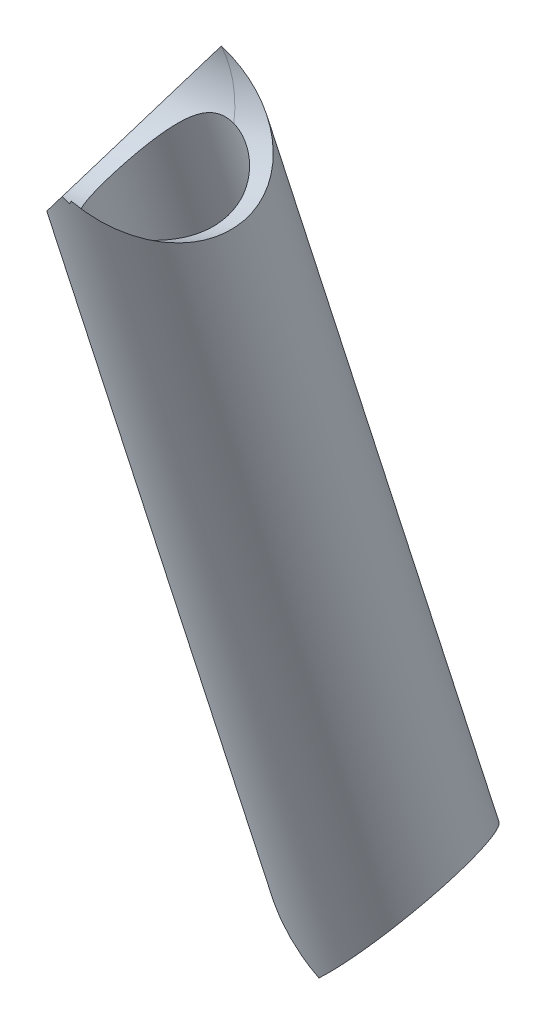
ISO-10303-21;
HEADER;
FILE_DESCRIPTION(('STEP AP214'),'2;1');
FILE_NAME('part.step','',(''),(''),'','','');
FILE_SCHEMA(('AUTOMOTIVE_DESIGN { 1 0 10303 214 1 1 1 1 }'));
ENDSEC;
DATA;
#1=APPLICATION_CONTEXT('core data for automotive mechanical design processes');
#2=APPLICATION_PROTOCOL_DEFINITION('international standard','automotive_design',2000,#1);
#3=PRODUCT_CONTEXT('',#1,'mechanical');
#4=PRODUCT('Part','Part','',(#3));
#5=PRODUCT_RELATED_PRODUCT_CATEGORY('part','',(#4));
#6=PRODUCT_DEFINITION_FORMATION('','',#4);
#7=PRODUCT_DEFINITION_CONTEXT('part definition',#1,'design');
#8=PRODUCT_DEFINITION('design','',#6,#7);
#9=PRODUCT_DEFINITION_SHAPE('','',#8);
#10=(LENGTH_UNIT() NAMED_UNIT(*) SI_UNIT(.MILLI.,.METRE.));
#11=(NAMED_UNIT(*) PLANE_ANGLE_UNIT() SI_UNIT($,.RADIAN.));
#12=(NAMED_UNIT(*) SI_UNIT($,.STERADIAN.) SOLID_ANGLE_UNIT());
#13=UNCERTAINTY_MEASURE_WITH_UNIT(LENGTH_MEASURE(1.E-05),#10,'distance_accuracy_value','');
#14=(GEOMETRIC_REPRESENTATION_CONTEXT(3) GLOBAL_UNCERTAINTY_ASSIGNED_CONTEXT((#13)) GLOBAL_UNIT_ASSIGNED_CONTEXT((#10,
#11,#12)) REPRESENTATION_CONTEXT('',''));
#15=CARTESIAN_POINT('',(0.,0.,0.));
#16=DIRECTION('',(0.,0.,1.));
#17=DIRECTION('',(1.,0.,0.));
#18=AXIS2_PLACEMENT_3D('',#15,#16,#17);
#19=CARTESIAN_POINT('',(549.76326332179,1.17961196366423E-13,200.));
#20=DIRECTION('',(0.,0.95272535252887,0.303832853142546));
#21=DIRECTION('',(0.,-0.303832853142546,0.952725352528871));
#22=AXIS2_PLACEMENT_3D('',#19,#20,#21);
#23=CYLINDRICAL_SURFACE('',#22,9.65000000000003);
#24=CARTESIAN_POINT('',(550.698039428662,109.484435551692,244.996794368476));
#25=CARTESIAN_POINT('',(550.881581643102,109.566394338462,245.004213785763));
#26=CARTESIAN_POINT('',(551.067205147599,109.644542456331,245.004567755101));
#27=CARTESIAN_POINT('',(551.441272790003,109.792442626243,244.990319027908));
#28=CARTESIAN_POINT('',(551.629717996396,109.862191402456,244.97571051683));
#29=CARTESIAN_POINT('',(552.006309312038,109.991890817097,244.930898310792));
#30=CARTESIAN_POINT('',(552.194443954556,110.051920856962,244.900830360672));
#31=CARTESIAN_POINT('',(552.570217718864,110.162658830874,244.824920725487));
#32=CARTESIAN_POINT('',(552.757856955263,110.213369149442,244.77908308386));
#33=CARTESIAN_POINT('',(553.131337378484,110.305875102178,244.671707070123));
#34=CARTESIAN_POINT('',(553.317173070384,110.347648714515,244.610130715032));
#35=CARTESIAN_POINT('',(553.684904472099,110.422906426049,244.471971576444));
#36=CARTESIAN_POINT('',(553.866799660256,110.456389433752,244.395386819401));
#37=CARTESIAN_POINT('',(554.225484036437,110.516245356894,244.228022283843));
#38=CARTESIAN_POINT('',(554.402264543243,110.54260675216,244.137219876654));
#39=CARTESIAN_POINT('',(554.749321723969,110.589495836218,243.942584303863));
#40=CARTESIAN_POINT('',(554.919596748016,110.610022053525,243.838747860903));
#41=CARTESIAN_POINT('',(555.299177028189,110.651736875844,243.588575847054));
#42=CARTESIAN_POINT('',(555.506148369993,110.671518490651,243.438457210947));
#43=CARTESIAN_POINT('',(555.906788012326,110.706638809108,243.120934223244));
#44=CARTESIAN_POINT('',(556.100452562977,110.721976264272,242.953525032138));
#45=CARTESIAN_POINT('',(556.473769897959,110.750737217947,242.603205122193));
#46=CARTESIAN_POINT('',(556.653405791074,110.764158424818,242.420276253129));
#47=CARTESIAN_POINT('',(556.997666401102,110.791242420639,242.040864301523));
#48=CARTESIAN_POINT('',(557.162292190321,110.804905192248,241.844382188974));
#49=CARTESIAN_POINT('',(557.478348379293,110.834550919873,241.436261312558));
#50=CARTESIAN_POINT('',(557.629530642542,110.850566975223,241.224432829273));
#51=CARTESIAN_POINT('',(557.915033371628,110.886373108481,240.790003674337));
#52=CARTESIAN_POINT('',(558.049353720248,110.906163212622,240.567402927815));
#53=CARTESIAN_POINT('',(558.300343888742,110.950843614606,240.1130933081));
#54=CARTESIAN_POINT('',(558.417022553328,110.975731341903,239.881389072871));
#55=CARTESIAN_POINT('',(558.632072138232,111.031693868641,239.41034225666));
#56=CARTESIAN_POINT('',(558.73044238973,111.062768894023,239.170999397007));
#57=CARTESIAN_POINT('',(558.914537580053,111.134441459816,238.66887530459));
#58=CARTESIAN_POINT('',(558.998844049748,111.175563161971,238.405646463527));
#59=CARTESIAN_POINT('',(559.14474216268,111.26663147728,237.874436356593));
#60=CARTESIAN_POINT('',(559.206332567954,111.316578571175,237.606454832547));
#61=CARTESIAN_POINT('',(559.306082308514,111.42572068666,237.068043330455));
#62=CARTESIAN_POINT('',(559.34424420614,111.484914696041,236.797613623447));
#63=CARTESIAN_POINT('',(559.396629612229,111.612668506386,236.2566534733));
#64=CARTESIAN_POINT('',(559.410854975487,111.681227581225,235.986123039592));
#65=CARTESIAN_POINT('',(559.41497267861,111.822775813274,235.464792583113));
#66=CARTESIAN_POINT('',(559.406378912521,111.895191884138,235.213847854031));
#67=CARTESIAN_POINT('',(559.368035815093,112.047628921864,234.715920544952));
#68=CARTESIAN_POINT('',(559.338287390049,112.127649562809,234.468937795682));
#69=CARTESIAN_POINT('',(559.257879022078,112.294648434509,233.980850403866));
#70=CARTESIAN_POINT('',(559.207222671558,112.381625467945,233.739744759047));
#71=CARTESIAN_POINT('',(559.08545419463,112.561710102316,233.265112507336));
#72=CARTESIAN_POINT('',(559.014342171348,112.654817672343,233.031585862242));
#73=CARTESIAN_POINT('',(558.854852446097,112.843140803751,232.58085840355));
#74=CARTESIAN_POINT('',(558.767084963752,112.938199118691,232.363375364454));
#75=CARTESIAN_POINT('',(558.573698403751,113.132029938323,231.938240267824));
#76=CARTESIAN_POINT('',(558.468079840252,113.230802335974,231.730587927359));
#77=CARTESIAN_POINT('',(558.239827336573,113.43085231516,231.326173037617));
#78=CARTESIAN_POINT('',(558.117195261543,113.532129621088,231.12940929795));
#79=CARTESIAN_POINT('',(557.855783983508,113.73588508475,230.747580192732));
#80=CARTESIAN_POINT('',(557.717004132927,113.838363290496,230.562515296802));
#81=CARTESIAN_POINT('',(557.417454025893,114.04779533895,230.196500000782));
#82=CARTESIAN_POINT('',(557.255965694797,114.154738123503,230.016130864163));
#83=CARTESIAN_POINT('',(556.917315168159,114.36656108676,229.669445096046));
#84=CARTESIAN_POINT('',(556.740152440746,114.471441195325,229.503128941775));
#85=CARTESIAN_POINT('',(556.370804864086,114.67731490012,229.184630482026));
#86=CARTESIAN_POINT('',(556.17859413249,114.778301333519,229.032473559324));
#87=CARTESIAN_POINT('',(555.780365612246,114.973919860812,228.742837046828));
#88=CARTESIAN_POINT('',(555.574347472067,115.068551792801,228.605357830953));
#89=CARTESIAN_POINT('',(555.136205118418,115.254475255379,228.337075078194));
#90=CARTESIAN_POINT('',(554.903254144052,115.345192436493,228.20721937849));
#91=CARTESIAN_POINT('',(554.423984993501,115.512913232271,227.964174746746));
#92=CARTESIAN_POINT('',(554.177664101202,115.589914046731,227.850989218744));
#93=CARTESIAN_POINT('',(553.674012405421,115.725757345622,227.641584260961));
#94=CARTESIAN_POINT('',(553.416719274576,115.78465703395,227.545311803749));
#95=CARTESIAN_POINT('',(552.892562630669,115.879942104992,227.369193553604));
#96=CARTESIAN_POINT('',(552.625705560243,115.916342353425,227.28933693781));
#97=CARTESIAN_POINT('',(552.172695592737,115.954626211558,227.168930621738));
#98=CARTESIAN_POINT('',(551.98830034342,115.963859191771,227.124014028903));
#99=CARTESIAN_POINT('',(551.617736437598,115.968626230974,227.041423558787));
#100=CARTESIAN_POINT('',(551.431568284748,115.96416407124,227.00374768537));
#101=CARTESIAN_POINT('',(551.058960029859,115.940610303518,226.935455022241));
#102=CARTESIAN_POINT('',(550.872520152049,115.921527297861,226.90483409545));
#103=CARTESIAN_POINT('',(550.500862439488,115.868320136744,226.850362452704));
#104=CARTESIAN_POINT('',(550.315644350711,115.834199214752,226.826510283135));
#105=CARTESIAN_POINT('',(549.890174376933,115.737950368295,226.778759760704));
#106=CARTESIAN_POINT('',(549.650857480254,115.670397418027,226.757187374206));
#107=CARTESIAN_POINT('',(549.297590076094,115.551063811716,226.732497674503));
#108=CARTESIAN_POINT('',(549.180755973486,115.508271781476,226.725545111857));
#109=CARTESIAN_POINT('',(548.94919801947,115.417028447761,226.71408248341));
#110=CARTESIAN_POINT('',(548.834474108189,115.368577305141,226.709572348204));
#111=CARTESIAN_POINT('',(548.720894557649,115.317466106978,226.706224291481));
#112=B_SPLINE_CURVE_WITH_KNOTS('',3,(#24,#25,#26,#27,#28,#29,#30,#31,#32,#33,#34,#35,#36,#37,
#38,#39,#40,#41,#42,#43,#44,#45,#46,#47,#48,#49,#50,#51,#52,#53,#54,#55,#56,#57,#58,#59,#60,#61,
#62,#63,#64,#65,#66,#67,#68,#69,#70,#71,#72,#73,#74,#75,#76,#77,#78,#79,#80,#81,#82,#83,#84,#85,
#86,#87,#88,#89,#90,#91,#92,#93,#94,#95,#96,#97,#98,#99,#100,#101,#102,#103,#104,#105,#106,#107,
#108,#109,#110,#111),.UNSPECIFIED.,.F.,.F.,(4,2,2,2,2,2,2,2,2,2,2,2,2,2,2,2,2,2,2,2,2,2,2,2,2,2,
2,2,2,2,2,2,2,2,2,2,2,2,2,2,2,2,2,4),(0.,0.603401911009914,1.20703839807765,1.80546282042542,
2.40373391754958,3.0034627125777,3.6032704225785,4.20404267070255,4.80496628437935,
5.57321395701299,6.34167724277525,7.11105197133311,7.88037169345746,8.66178608143956,
9.44320590124379,10.2242326454021,11.0052879154709,11.8425224944068,12.6798026935898,
13.5169913043671,14.3541150400877,15.1371105115038,15.9200724402833,16.7028998962525,
17.4857234057292,18.2440396320003,19.0023340204592,19.7605453445096,20.518787085754,
21.3119222678827,22.1050843734451,22.8996420142938,23.6942198918678,24.538244731251,
25.3824416816996,26.2239426625353,27.064887055007,27.6343517263137,28.2036591805505,
28.7726319335976,29.3414824051636,30.0885224507664,30.462236794177,30.8359405176508),.UNSPECIFIED.);
#113=CARTESIAN_POINT('',(552.9506630298,110.261122917512,244.723648048167));
#114=VERTEX_POINT('',#113);
#115=CARTESIAN_POINT('',(552.000788998511,115.961111324283,227.128263209496));
#116=VERTEX_POINT('',#115);
#117=EDGE_CURVE('E123',#114,#116,#112,.T.);
#118=ORIENTED_EDGE('',*,*,#117,.T.);
#119=CARTESIAN_POINT('',(549.76326332179,109.975863240767,245.201148674115));
#120=CARTESIAN_POINT('',(549.9634546001,110.019916320632,245.215196869599));
#121=CARTESIAN_POINT('',(550.165307901028,110.059083582522,245.221137583805));
#122=CARTESIAN_POINT('',(550.570552825056,110.127049074594,245.216106583122));
#123=CARTESIAN_POINT('',(550.773944438698,110.155847368475,245.205134972132));
#124=CARTESIAN_POINT('',(551.180423033904,110.203144725606,245.16612172139));
#125=CARTESIAN_POINT('',(551.383509708,110.221636660967,245.138068295826));
#126=CARTESIAN_POINT('',(551.787316770269,110.248998695428,245.065298121469));
#127=CARTESIAN_POINT('',(551.98803699928,110.257868150948,245.020580258379));
#128=CARTESIAN_POINT('',(552.383703703847,110.267166591259,244.915794468131));
#129=CARTESIAN_POINT('',(552.578685512266,110.267669415926,244.855865572658));
#130=CARTESIAN_POINT('',(552.963528778638,110.261908055358,244.721530033714));
#131=CARTESIAN_POINT('',(553.15338755417,110.255640392959,244.647115967093));
#132=CARTESIAN_POINT('',(553.714229729974,110.229072097724,244.403684156985));
#133=CARTESIAN_POINT('',(554.07628523899,110.201004703115,244.214529724227));
#134=CARTESIAN_POINT('',(554.666278688278,110.146113621938,243.855499316274));
#135=CARTESIAN_POINT('',(554.90165491087,110.12148241524,243.697102594484));
#136=CARTESIAN_POINT('',(555.358004067127,110.071501830009,243.360642036257));
#137=CARTESIAN_POINT('',(555.578972330568,110.046152222395,243.182571872731));
#138=CARTESIAN_POINT('',(556.005820845144,109.997716098286,242.808634613583));
#139=CARTESIAN_POINT('',(556.211689075402,109.97463138,242.612753611002));
#140=CARTESIAN_POINT('',(556.607410978175,109.933294290981,242.204993684445));
#141=CARTESIAN_POINT('',(556.797266232797,109.91504144247,241.993116344861));
#142=CARTESIAN_POINT('',(557.16199318824,109.885404324874,241.552591687812));
#143=CARTESIAN_POINT('',(557.336686679089,109.874094169562,241.323791676807));
#144=CARTESIAN_POINT('',(557.667738161875,109.860603739476,240.853003599556));
#145=CARTESIAN_POINT('',(557.82409565684,109.858423712105,240.611015176116));
#146=CARTESIAN_POINT('',(558.117116334747,109.864874764263,240.115731230429));
#147=CARTESIAN_POINT('',(558.253793105132,109.873498344766,239.862443668809));
#148=CARTESIAN_POINT('',(558.506224741361,109.902947677151,239.34631550793));
#149=CARTESIAN_POINT('',(558.621980840241,109.923772709591,239.083475472778));
#150=CARTESIAN_POINT('',(558.828082916247,109.977900091243,238.558362449391));
#151=CARTESIAN_POINT('',(558.919084636021,110.01081114634,238.296307051674));
#152=CARTESIAN_POINT('',(559.078946387722,110.089836451659,237.76744963628));
#153=CARTESIAN_POINT('',(559.147806588626,110.135950601113,237.500647654845));
#154=CARTESIAN_POINT('',(559.262355117916,110.241678135343,236.964920118654));
#155=CARTESIAN_POINT('',(559.308057990581,110.301283012962,236.695996004802));
#156=CARTESIAN_POINT('',(559.375637075682,110.433943460572,236.158480587196));
#157=CARTESIAN_POINT('',(559.397516112611,110.506997434873,235.889889247762));
#158=CARTESIAN_POINT('',(559.415953366756,110.656731163836,235.387073849114));
#159=CARTESIAN_POINT('',(559.415182232547,110.731978842211,235.152516344233));
#160=CARTESIAN_POINT('',(559.394828533204,110.891991545254,234.687516635222));
#161=CARTESIAN_POINT('',(559.375247702842,110.976755691605,234.457074053578));
#162=CARTESIAN_POINT('',(559.317527538014,111.155000094427,234.001988694555));
#163=CARTESIAN_POINT('',(559.279389686438,111.248479653968,233.777345455261));
#164=CARTESIAN_POINT('',(559.185022271188,111.44318287009,233.335337647127));
#165=CARTESIAN_POINT('',(559.12879236789,111.544406672018,233.117973215008));
#166=CARTESIAN_POINT('',(559.000371600791,111.751078284084,232.696698650233));
#167=CARTESIAN_POINT('',(558.928574897405,111.85637667972,232.492594559923));
#168=CARTESIAN_POINT('',(558.769042116872,112.072137351278,232.09357475383));
#169=CARTESIAN_POINT('',(558.681306482387,112.182599483728,231.89865878306));
#170=CARTESIAN_POINT('',(558.490685437882,112.407459048784,231.518806508098));
#171=CARTESIAN_POINT('',(558.387801531828,112.521856089858,231.33386921568));
#172=CARTESIAN_POINT('',(558.16766851358,112.753333443992,230.974509955233));
#173=CARTESIAN_POINT('',(558.050417781106,112.87041405849,230.800089176564));
#174=CARTESIAN_POINT('',(557.79135055153,113.11635895838,230.447211623137));
#175=CARTESIAN_POINT('',(557.648278285843,113.245349010812,230.269764019591));
#176=CARTESIAN_POINT('',(557.346974508563,113.503158797502,229.928116467741));
#177=CARTESIAN_POINT('',(557.188742149096,113.631978521825,229.763917261338));
#178=CARTESIAN_POINT('',(556.857648324522,113.887788248378,229.448615885941));
#179=CARTESIAN_POINT('',(556.684760892019,114.014774515625,229.297537967432));
#180=CARTESIAN_POINT('',(556.325318993714,114.264610029118,229.008821105734));
#181=CARTESIAN_POINT('',(556.138764223729,114.387459183199,228.871182461812));
#182=CARTESIAN_POINT('',(555.730287647052,114.640530891462,228.594147632414));
#183=CARTESIAN_POINT('',(555.506768715832,114.769968738686,228.456381003873));
#184=CARTESIAN_POINT('',(555.044138173575,115.017160632341,228.197282697493));
#185=CARTESIAN_POINT('',(554.805022261513,115.134911433186,228.07595558164));
#186=CARTESIAN_POINT('',(554.312644914728,115.354025867711,227.84989583402));
#187=CARTESIAN_POINT('',(554.059418715352,115.455428057967,227.745124169849));
#188=CARTESIAN_POINT('',(553.539565934702,115.636988281309,227.55178657457));
#189=CARTESIAN_POINT('',(553.272949122394,115.717161541404,227.463209041988));
#190=CARTESIAN_POINT('',(552.824755455249,115.827013239295,227.330704057435));
#191=CARTESIAN_POINT('',(552.646463192946,115.864521215445,227.282066722795));
#192=CARTESIAN_POINT('',(552.286004325275,115.92681066068,227.191541813069));
#193=CARTESIAN_POINT('',(552.103838996273,115.951596256737,227.149652052189));
#194=CARTESIAN_POINT('',(551.737025438186,115.98709452443,227.072678501808));
#195=CARTESIAN_POINT('',(551.552381914302,115.997830858015,227.037583353916));
#196=CARTESIAN_POINT('',(551.181667380839,116.004352674121,226.974084567425));
#197=CARTESIAN_POINT('',(550.99559635377,116.000137973163,226.945681010948));
#198=CARTESIAN_POINT('',(550.623061856763,115.97629910435,226.895430534109));
#199=CARTESIAN_POINT('',(550.436598614483,115.956635164842,226.873600737788));
#200=CARTESIAN_POINT('',(550.065278379949,115.90204078665,226.836467912011));
#201=CARTESIAN_POINT('',(549.880421369628,115.867110519894,226.821164809057));
#202=CARTESIAN_POINT('',(549.513439215618,115.782709943031,226.79689176459));
#203=CARTESIAN_POINT('',(549.331317298806,115.73322368968,226.787928804314));
#204=CARTESIAN_POINT('',(548.971006729789,115.620932728738,226.776152520109));
#205=CARTESIAN_POINT('',(548.792819228331,115.558124180121,226.773340972379));
#206=CARTESIAN_POINT('',(548.379848438894,115.396700469569,226.773719529044));
#207=CARTESIAN_POINT('',(548.146960302229,115.293232295231,226.779340027354));
#208=CARTESIAN_POINT('',(547.690474654813,115.068461753578,226.800956057156));
#209=CARTESIAN_POINT('',(547.466880860139,114.947152339269,226.816955696793));
#210=CARTESIAN_POINT('',(547.028522828361,114.68981885095,226.859109652717));
#211=CARTESIAN_POINT('',(546.813785620311,114.553753757949,226.885292828348));
#212=CARTESIAN_POINT('',(546.393587795436,114.270194573631,226.947694627227));
#213=CARTESIAN_POINT('',(546.188127232081,114.12270041645,226.983913308309));
#214=CARTESIAN_POINT('',(545.690426062326,113.74647561094,227.086058375244));
#215=CARTESIAN_POINT('',(545.403376366959,113.512465551212,227.157921715903));
#216=CARTESIAN_POINT('',(544.847363307928,113.031251542761,227.324302964778));
#217=CARTESIAN_POINT('',(544.578409130546,112.784041005272,227.418832270005));
#218=CARTESIAN_POINT('',(544.058219571466,112.281513503806,227.631729483467));
#219=CARTESIAN_POINT('',(543.806979909307,112.026198519926,227.750091606003));
#220=CARTESIAN_POINT('',(543.322465974213,111.511750381845,228.012256113292));
#221=CARTESIAN_POINT('',(543.089184234729,111.252618868457,228.15604784202));
#222=CARTESIAN_POINT('',(542.693159774841,110.794199446877,228.434734406057));
#223=CARTESIAN_POINT('',(542.526539305416,110.594864638065,228.564060197769));
#224=CARTESIAN_POINT('',(542.205438016533,110.198230879066,228.839884202087));
#225=CARTESIAN_POINT('',(542.050957207784,110.000931930674,228.986382429841));
#226=CARTESIAN_POINT('',(541.755654889493,109.610880123103,229.297169381766));
#227=CARTESIAN_POINT('',(541.614809450212,109.418119766042,229.461425827097));
#228=CARTESIAN_POINT('',(541.348105636225,109.039249332012,229.808672344227));
#229=CARTESIAN_POINT('',(541.222241438681,108.853136691055,229.99165508581));
#230=CARTESIAN_POINT('',(541.015760298076,108.534094796603,230.330324404103));
#231=CARTESIAN_POINT('',(540.931552718786,108.399166555664,230.481947201521));
#232=CARTESIAN_POINT('',(540.773866289386,108.136128246428,230.796163573139));
#233=CARTESIAN_POINT('',(540.700381304537,108.008014306327,230.958750795761));
#234=CARTESIAN_POINT('',(540.565117055794,107.760008762316,231.29468557097));
#235=CARTESIAN_POINT('',(540.503335380576,107.640115467897,231.468030897188));
#236=CARTESIAN_POINT('',(540.392467147528,107.410029486356,231.824958004935));
#237=CARTESIAN_POINT('',(540.343380721977,107.299836900319,232.008539893101));
#238=CARTESIAN_POINT('',(540.258482834333,107.089786862604,232.386566584015));
#239=CARTESIAN_POINT('',(540.222783944748,106.990021928253,232.581088351116));
#240=CARTESIAN_POINT('',(540.166002506339,106.803283109686,232.978257787773));
#241=CARTESIAN_POINT('',(540.144919905149,106.716309179643,233.180905428213));
#242=CARTESIAN_POINT('',(540.117866654351,106.556355398659,233.5925220117));
#243=CARTESIAN_POINT('',(540.111888466098,106.483368583534,233.801487748648));
#244=CARTESIAN_POINT('',(540.115168413285,106.352146640046,234.223871262179));
#245=CARTESIAN_POINT('',(540.124425184088,106.293910190991,234.437288638327));
#246=CARTESIAN_POINT('',(540.155876129218,106.198811947143,234.840021792754));
#247=CARTESIAN_POINT('',(540.176334833758,106.160200223417,235.029065564939));
#248=CARTESIAN_POINT('',(540.2284303565,106.094558262766,235.407690100039));
#249=CARTESIAN_POINT('',(540.260071275486,106.067532282667,235.59727103461));
#250=CARTESIAN_POINT('',(540.334012807019,106.024828407898,235.97562156837));
#251=CARTESIAN_POINT('',(540.376313758545,106.009150874159,236.164391141565));
#252=CARTESIAN_POINT('',(540.470948023295,105.988686022466,236.540007276758));
#253=CARTESIAN_POINT('',(540.523283436459,105.98390098672,236.726853427595));
#254=CARTESIAN_POINT('',(540.654223571681,105.984744663654,237.152665718845));
#255=CARTESIAN_POINT('',(540.73601583267,105.993882791806,237.390654605637));
#256=CARTESIAN_POINT('',(540.913767351944,106.027938353897,237.860057627066));
#257=CARTESIAN_POINT('',(541.009730174823,106.052859763312,238.091470089891));
#258=CARTESIAN_POINT('',(541.316961370928,106.148927047828,238.774590645774));
#259=CARTESIAN_POINT('',(541.547484400736,106.241371793227,239.214903226503));
#260=CARTESIAN_POINT('',(541.970244419686,106.43361206851,239.924955111587));
#261=CARTESIAN_POINT('',(542.151611865375,106.521884939514,240.204678988825));
#262=CARTESIAN_POINT('',(542.531680084085,106.715018727272,240.746280918159));
#263=CARTESIAN_POINT('',(542.730387632222,106.819886140971,241.008151922963));
#264=CARTESIAN_POINT('',(543.144092194265,107.042893165864,241.513858674705));
#265=CARTESIAN_POINT('',(543.359131232113,107.161067422523,241.757644467474));
#266=CARTESIAN_POINT('',(543.804211273161,107.40703834607,242.225795854723));
#267=CARTESIAN_POINT('',(544.034250127505,107.534833635063,242.450164220251));
#268=CARTESIAN_POINT('',(544.516198841488,107.800541725061,242.88499198106));
#269=CARTESIAN_POINT('',(544.768554530637,107.938642034866,243.09484309286));
#270=CARTESIAN_POINT('',(545.28948826406,108.217551653759,243.491637990458));
#271=CARTESIAN_POINT('',(545.558072199016,108.358361933745,243.678573382606));
#272=CARTESIAN_POINT('',(546.111342556936,108.637620124482,244.026424740333));
#273=CARTESIAN_POINT('',(546.395969488808,108.776074566508,244.187429267102));
#274=CARTESIAN_POINT('',(546.982858672242,109.045532171543,244.480362911299));
#275=CARTESIAN_POINT('',(547.285103277819,109.176542539353,244.612320510282));
#276=CARTESIAN_POINT('',(547.937928888575,109.436475440679,244.853052236188));
#277=CARTESIAN_POINT('',(548.290374491198,109.564018441295,244.958435126517));
#278=CARTESIAN_POINT('',(548.833304491107,109.735185653313,245.079064636691));
#279=CARTESIAN_POINT('',(549.016574484542,109.788864352978,245.11302696243));
#280=CARTESIAN_POINT('',(549.387159273421,109.888429217533,245.167441886946));
#281=CARTESIAN_POINT('',(549.574472237791,109.934318829984,245.187900474314));
#282=CARTESIAN_POINT('',(549.76326332179,109.975863240767,245.201148674115));
#283=B_SPLINE_CURVE_WITH_KNOTS('',3,(#119,#120,#121,#122,#123,#124,#125,#126,#127,#128,#129,
#130,#131,#132,#133,#134,#135,#136,#137,#138,#139,#140,#141,#142,#143,#144,#145,#146,#147,#148,
#149,#150,#151,#152,#153,#154,#155,#156,#157,#158,#159,#160,#161,#162,#163,#164,#165,#166,#167,
#168,#169,#170,#171,#172,#173,#174,#175,#176,#177,#178,#179,#180,#181,#182,#183,#184,#185,#186,
#187,#188,#189,#190,#191,#192,#193,#194,#195,#196,#197,#198,#199,#200,#201,#202,#203,#204,#205,
#206,#207,#208,#209,#210,#211,#212,#213,#214,#215,#216,#217,#218,#219,#220,#221,#222,#223,#224,
#225,#226,#227,#228,#229,#230,#231,#232,#233,#234,#235,#236,#237,#238,#239,#240,#241,#242,#243,
#244,#245,#246,#247,#248,#249,#250,#251,#252,#253,#254,#255,#256,#257,#258,#259,#260,#261,#262,
#263,#264,#265,#266,#267,#268,#269,#270,#271,#272,#273,#274,#275,#276,#277,#278,#279,#280,#281,
#282),.UNSPECIFIED.,.T.,.F.,(4,2,2,2,2,2,2,2,2,2,2,2,2,2,2,2,2,2,2,2,2,2,2,2,2,2,2,2,2,2,2,2,2,
2,2,2,2,2,2,2,2,2,2,2,2,2,2,2,2,2,2,2,2,2,2,2,2,2,2,2,2,2,2,2,2,2,2,2,2,2,2,2,2,2,2,2,2,2,2,2,2,
4),(0.,0.616169531446662,1.23233527751867,1.84892663732323,2.46555923395674,3.0767468112761,
3.68824842967294,4.91184767117764,5.76528018930683,6.61898797946948,7.47336817689521,
8.32766386111556,9.19092744856187,10.054214428202,10.9169025128609,11.7795397352608,
12.6164089643081,13.4532718065052,14.289608391957,15.125845812681,15.8639281070358,
16.6019423363992,17.339897600816,18.0778667189189,18.7989695164123,19.5200522902497,
20.2410635210506,20.9621561419184,21.7470721693637,22.5320321211617,23.3184132468746,
24.1048118797398,24.9819457509242,25.8593225316241,26.7345988414684,27.609245625165,
28.1744582525344,28.7394874163607,29.3035637207212,29.867646947465,30.4331870956101,
30.9987208748308,31.5648764073111,32.1311953936488,32.8946879732715,33.6584829336766,
34.4244583888087,35.1904382584323,36.3206425205577,37.4514162736856,38.5819158483369,
39.7119428159567,40.5818909940019,41.451839939445,42.320233364585,43.1882881568142,
43.846937574009,44.5052086666952,45.1633439827495,45.8214861560418,46.4850445960519,
47.1486006586479,47.8118254734791,48.4749908847163,49.0564072482483,49.638037052712,
50.2196853548282,50.8014555132847,51.5557677532985,52.3102700642073,53.8201407029631,
54.8536123698262,55.8874896578559,56.9241238432006,57.9606098463812,59.0277756588978,
60.0953311960612,61.1591596562796,62.2219403014201,63.3856386186772,63.9669774304113,
64.548058258465),.UNSPECIFIED.);
#284=EDGE_CURVE('E108',#116,#114,#283,.T.);
#285=ORIENTED_EDGE('',*,*,#284,.T.);
#286=EDGE_LOOP('',(#118,#285));
#287=FACE_BOUND('',#286,.T.);
#288=CARTESIAN_POINT('',(549.76326332179,4.93405758676842,211.702353427001));
#289=CARTESIAN_POINT('',(549.539382373849,4.93406342137036,211.702352633379));
#290=CARTESIAN_POINT('',(549.315467333172,4.94515863877274,211.69769189549));
#291=CARTESIAN_POINT('',(548.870141430401,4.9889123854776,211.679096439812));
#292=CARTESIAN_POINT('',(548.648731172296,5.02157600747869,211.665159531742));
#293=CARTESIAN_POINT('',(548.209954175847,5.10683350079741,211.628086715795));
#294=CARTESIAN_POINT('',(547.992600772254,5.15948395384225,211.604924682805));
#295=CARTESIAN_POINT('',(547.564056959244,5.28228048027909,211.549546927131));
#296=CARTESIAN_POINT('',(547.352869013883,5.35243344454773,211.517327637901));
#297=CARTESIAN_POINT('',(546.894798854644,5.52357016230345,211.436383431863));
#298=CARTESIAN_POINT('',(546.64954129666,5.62792862982246,211.385624628943));
#299=CARTESIAN_POINT('',(546.170197428191,5.85374599420569,211.271187764417));
#300=CARTESIAN_POINT('',(545.936114353462,5.97520980446699,211.207505988446));
#301=CARTESIAN_POINT('',(545.479183708733,6.23143778474619,211.067092877763));
#302=CARTESIAN_POINT('',(545.25634644083,6.36621382730404,210.990349849436));
#303=CARTESIAN_POINT('',(544.822200053088,6.64568072831884,210.823650244243));
#304=CARTESIAN_POINT('',(544.610889940415,6.79037073045706,210.733694807834));
#305=CARTESIAN_POINT('',(544.194956599262,7.09045100515503,210.537948424183));
#306=CARTESIAN_POINT('',(543.990611148519,7.24601374274605,210.431832281636));
#307=CARTESIAN_POINT('',(543.594262008462,7.56214160906966,210.204992451836));
#308=CARTESIAN_POINT('',(543.402258713888,7.72270689755554,210.084268297729));
#309=CARTESIAN_POINT('',(543.031188721571,8.04646301319454,209.827870724339));
#310=CARTESIAN_POINT('',(542.852111874307,8.20965165469263,209.692209249572));
#311=CARTESIAN_POINT('',(542.507419928198,8.53668655044997,209.405438687285));
#312=CARTESIAN_POINT('',(542.341804195637,8.70053277337035,209.254330327724));
#313=CARTESIAN_POINT('',(542.031624071376,9.01999803058381,208.943001327277));
#314=CARTESIAN_POINT('',(541.886467779545,9.1756736673092,208.783429621454));
#315=CARTESIAN_POINT('',(541.610421834209,9.48393590934119,208.449648178238));
#316=CARTESIAN_POINT('',(541.479530072152,9.63652296847231,208.275440611047));
#317=CARTESIAN_POINT('',(541.233196878122,9.93677164681734,207.912398587017));
#318=CARTESIAN_POINT('',(541.117756291123,10.0844329963294,207.72356333113));
#319=CARTESIAN_POINT('',(540.903679522184,10.372882503838,207.331609950067));
#320=CARTESIAN_POINT('',(540.805043207599,10.5136707160816,207.128491937652));
#321=CARTESIAN_POINT('',(540.62513881932,10.78765939194,206.706729085931));
#322=CARTESIAN_POINT('',(540.544041143911,10.920776930604,206.487957205291));
#323=CARTESIAN_POINT('',(540.401776604969,11.1759534437133,206.037796535081));
#324=CARTESIAN_POINT('',(540.340610036993,11.2980122541509,205.806407558474));
#325=CARTESIAN_POINT('',(540.23945886749,11.5290245895431,205.332999473607));
#326=CARTESIAN_POINT('',(540.199452060887,11.6379917596709,205.090991798697));
#327=CARTESIAN_POINT('',(540.14139179329,11.8412850236347,204.59836121107));
#328=CARTESIAN_POINT('',(540.12333433724,11.9356137791184,204.347739874689));
#329=CARTESIAN_POINT('',(540.110619452725,12.0950920883933,203.879461933705));
#330=CARTESIAN_POINT('',(540.112795475943,12.1624980533817,203.662650736906));
#331=CARTESIAN_POINT('',(540.133110055637,12.285414423542,203.226440315285));
#332=CARTESIAN_POINT('',(540.151246665382,12.3409262784256,203.007041409308));
#333=CARTESIAN_POINT('',(540.203188628909,12.4398284841818,202.567381736479));
#334=CARTESIAN_POINT('',(540.236994006433,12.4832188166868,202.347120968321));
#335=CARTESIAN_POINT('',(540.319754189131,12.5579272912323,201.907406220708));
#336=CARTESIAN_POINT('',(540.368709401112,12.5892451090487,201.687952263079));
#337=CARTESIAN_POINT('',(540.479291544733,12.6392997087684,201.258329127057));
#338=CARTESIAN_POINT('',(540.540468143555,12.658403465506,201.048085985577));
#339=CARTESIAN_POINT('',(540.675661666445,12.6860372814786,200.630998059639));
#340=CARTESIAN_POINT('',(540.749683005687,12.6945636966824,200.424154470574));
#341=CARTESIAN_POINT('',(540.909745174142,12.7016381457526,200.01508576223));
#342=CARTESIAN_POINT('',(540.99578244791,12.7001891251902,199.812859297291));
#343=CARTESIAN_POINT('',(541.179138877267,12.6880356550713,199.413808615137));
#344=CARTESIAN_POINT('',(541.276462073463,12.6773278817655,199.216986364133));
#345=CARTESIAN_POINT('',(541.495117119762,12.6454781114544,198.80408762712));
#346=CARTESIAN_POINT('',(541.617923149336,12.6231490725311,198.58888314835));
#347=CARTESIAN_POINT('',(541.876052067137,12.5688649180614,198.167287152885));
#348=CARTESIAN_POINT('',(542.011380274374,12.5369056988033,197.960899436173));
#349=CARTESIAN_POINT('',(542.293800682272,12.464613101556,197.557576524867));
#350=CARTESIAN_POINT('',(542.440904355347,12.4242714943326,197.360650855126));
#351=CARTESIAN_POINT('',(542.746012680416,12.336583045285,196.977186795768));
#352=CARTESIAN_POINT('',(542.904014510528,12.2892380132646,196.790645739681));
#353=CARTESIAN_POINT('',(543.263803932326,12.1786586729623,196.391473441971));
#354=CARTESIAN_POINT('',(543.467939883751,12.1141546808253,196.181303497993));
#355=CARTESIAN_POINT('',(543.890709042671,11.979546029248,195.777951131971));
#356=CARTESIAN_POINT('',(544.109345734109,11.9094400230345,195.584772818453));
#357=CARTESIAN_POINT('',(544.560790617383,11.7664762461639,195.216804011491));
#358=CARTESIAN_POINT('',(544.793598481995,11.6936185390604,195.042013093721));
#359=CARTESIAN_POINT('',(545.273099502032,11.5484564816201,194.71269780691));
#360=CARTESIAN_POINT('',(545.519787597184,11.4761519403986,194.558166119568));
#361=CARTESIAN_POINT('',(546.139558181117,11.3047420017805,194.208147191182));
#362=CARTESIAN_POINT('',(546.520355678166,11.2078990534776,194.024702993827));
#363=CARTESIAN_POINT('',(547.111370178833,11.0797401192274,193.792160500008));
#364=CARTESIAN_POINT('',(547.311530037011,11.0398934592127,193.72178492024));
#365=CARTESIAN_POINT('',(547.718025086278,10.9677259409526,193.596547667879));
#366=CARTESIAN_POINT('',(547.924359054299,10.9354036031591,193.541682944847));
#367=CARTESIAN_POINT('',(548.308943754438,10.8844589932534,193.456253082277));
#368=CARTESIAN_POINT('',(548.486466801227,10.8644777058827,193.423215654452));
#369=CARTESIAN_POINT('',(548.844083331727,10.8320094389836,193.36987533511));
#370=CARTESIAN_POINT('',(549.024176268882,10.8195208895403,193.34956977591));
#371=CARTESIAN_POINT('',(549.385636804091,10.8026523780675,193.322203666124));
#372=CARTESIAN_POINT('',(549.567003516643,10.7982672534187,193.315134682598));
#373=CARTESIAN_POINT('',(549.92977969788,10.7978146098994,193.314403538476));
#374=CARTESIAN_POINT('',(550.111189167496,10.8017472926241,193.320741702823));
#375=CARTESIAN_POINT('',(550.47235202354,10.8177135263429,193.346632377511));
#376=CARTESIAN_POINT('',(550.652107865323,10.8297319742312,193.366160251542));
#377=CARTESIAN_POINT('',(551.009095827152,10.8612647973789,193.417915298583));
#378=CARTESIAN_POINT('',(551.186327942936,10.8807791852893,193.450142493025));
#379=CARTESIAN_POINT('',(551.537533118817,10.926456494852,193.526629336727));
#380=CARTESIAN_POINT('',(551.711501540779,10.9526282069991,193.570904900386));
#381=CARTESIAN_POINT('',(552.055268276707,11.0105628800184,193.670637619195));
#382=CARTESIAN_POINT('',(552.225065407578,11.0423274067736,193.726097906491));
#383=CARTESIAN_POINT('',(552.638785919913,11.1263351912132,193.875859596047));
#384=CARTESIAN_POINT('',(552.880019719957,11.1811843927033,193.976161919446));
#385=CARTESIAN_POINT('',(553.351705987994,11.297153203595,194.196567097695));
#386=CARTESIAN_POINT('',(553.582153259684,11.3582757907785,194.316679372286));
#387=CARTESIAN_POINT('',(554.032373356822,11.4838136772769,194.574812681289));
#388=CARTESIAN_POINT('',(554.252126582628,11.5482346088917,194.712865013412));
#389=CARTESIAN_POINT('',(554.680440547356,11.6775770826515,195.00503056758));
#390=CARTESIAN_POINT('',(554.889002696555,11.7424985605337,195.159141758683));
#391=CARTESIAN_POINT('',(555.302719431692,11.8729839041846,195.488370191615));
#392=CARTESIAN_POINT('',(555.507434747137,11.9384765096275,195.664067235762));
#393=CARTESIAN_POINT('',(555.904566712812,12.0651962513141,196.030290465803));
#394=CARTESIAN_POINT('',(556.09698268149,12.1264231511956,196.220817472187));
#395=CARTESIAN_POINT('',(556.468902631432,12.2424637846262,196.615569644762));
#396=CARTESIAN_POINT('',(556.648418518758,12.2972834617467,196.819781834854));
#397=CARTESIAN_POINT('',(556.994122010467,12.3986464335782,197.241274941651));
#398=CARTESIAN_POINT('',(557.160305248248,12.4451870228155,197.458560099467));
#399=CARTESIAN_POINT('',(557.472240971025,12.5265194489631,197.896663075814));
#400=CARTESIAN_POINT('',(557.618532858205,12.5616937134726,198.117025081545));
#401=CARTESIAN_POINT('',(557.896819020558,12.6210581614447,198.568007647094));
#402=CARTESIAN_POINT('',(558.028815440998,12.6452499947434,198.798626660334));
#403=CARTESIAN_POINT('',(558.277241975125,12.6811300667518,199.268894870205));
#404=CARTESIAN_POINT('',(558.393681326995,12.6928257551236,199.508538598368));
#405=CARTESIAN_POINT('',(558.609723551993,12.702333134617,199.995573333888));
#406=CARTESIAN_POINT('',(558.709329222126,12.7001471345873,200.242963046097));
#407=CARTESIAN_POINT('',(558.876790122568,12.6821341789618,200.706346939758));
#408=CARTESIAN_POINT('',(558.947165454002,12.6683926849961,200.921513620141));
#409=CARTESIAN_POINT('',(559.073879364137,12.6293924203392,201.354902152932));
#410=CARTESIAN_POINT('',(559.13022037002,12.6041356433133,201.573123470149));
#411=CARTESIAN_POINT('',(559.228095725713,12.5417075831329,202.011087526713));
#412=CARTESIAN_POINT('',(559.269636652373,12.5045416061627,202.230829545925));
#413=CARTESIAN_POINT('',(559.337333870416,12.4181132708685,202.670320715021));
#414=CARTESIAN_POINT('',(559.363489986272,12.3688507745431,202.890069864956));
#415=CARTESIAN_POINT('',(559.400054880299,12.2581596300608,203.328479718245));
#416=CARTESIAN_POINT('',(559.410418981186,12.1966970188993,203.547135595593));
#417=CARTESIAN_POINT('',(559.415088147954,12.0620614139748,203.980987629718));
#418=CARTESIAN_POINT('',(559.409393182308,11.9888883972235,204.196183779701));
#419=CARTESIAN_POINT('',(559.382036923809,11.8314597102248,204.621469879456));
#420=CARTESIAN_POINT('',(559.360373667548,11.7472026781713,204.831559198026));
#421=CARTESIAN_POINT('',(559.301426956765,11.5684828866537,205.245087399045));
#422=CARTESIAN_POINT('',(559.264143703865,11.4740202589349,205.448526367298));
#423=CARTESIAN_POINT('',(559.176402680308,11.2800889705919,205.839103982424));
#424=CARTESIAN_POINT('',(559.126561550911,11.1809952476703,206.026568490652));
#425=CARTESIAN_POINT('',(559.013681955233,10.9753930754037,206.393353267755));
#426=CARTESIAN_POINT('',(558.950638918522,10.8688820667792,206.57267068992));
#427=CARTESIAN_POINT('',(558.812110319345,10.649583473597,206.9223521255));
#428=CARTESIAN_POINT('',(558.736627843009,10.5367974504083,207.092718345849));
#429=CARTESIAN_POINT('',(558.573946719227,10.3059788803286,207.424122730574));
#430=CARTESIAN_POINT('',(558.486743808719,10.1879444349371,207.585157470173));
#431=CARTESIAN_POINT('',(558.291712198447,9.93518977137495,207.913871299565));
#432=CARTESIAN_POINT('',(558.182680414839,9.80001474409459,208.080486561665));
#433=CARTESIAN_POINT('',(557.952199695958,9.52599373331054,208.4017886559));
#434=CARTESIAN_POINT('',(557.830745565628,9.38714623211353,208.556470449596));
#435=CARTESIAN_POINT('',(557.576274815343,9.10714603683795,208.853904431058));
#436=CARTESIAN_POINT('',(557.443253543937,8.96599243411774,208.996651773983));
#437=CARTESIAN_POINT('',(557.166428366807,8.68276285798567,209.270297523636));
#438=CARTESIAN_POINT('',(557.022623116443,8.54068677157456,209.401194448243));
#439=CARTESIAN_POINT('',(556.695228518769,8.22872404008184,209.676233847523));
#440=CARTESIAN_POINT('',(556.509414435304,8.05892527649337,209.817834180072));
#441=CARTESIAN_POINT('',(556.123941212171,7.72224744078713,210.084793477401));
#442=CARTESIAN_POINT('',(555.924279505436,7.55536891724154,210.210149418381));
#443=CARTESIAN_POINT('',(555.511491507018,7.22697018988427,210.445175573753));
#444=CARTESIAN_POINT('',(555.298356347662,7.0654536240068,210.554835299276));
#445=CARTESIAN_POINT('',(554.859012000488,6.75077482949568,210.758818337309));
#446=CARTESIAN_POINT('',(554.632805396261,6.59761096149247,210.85314466653));
#447=CARTESIAN_POINT('',(554.208609527982,6.32910252805274,211.011461171741));
#448=CARTESIAN_POINT('',(554.012717782549,6.21186404990076,211.077865392411));
#449=CARTESIAN_POINT('',(553.612130018637,5.98755065347733,211.20069562264));
#450=CARTESIAN_POINT('',(553.407433857382,5.88047590011412,211.257121470311));
#451=CARTESIAN_POINT('',(552.989763355923,5.67927758900892,211.359953921755));
#452=CARTESIAN_POINT('',(552.776804071785,5.58513177518542,211.406377823461));
#453=CARTESIAN_POINT('',(552.342758894801,5.41254817658329,211.489277565094));
#454=CARTESIAN_POINT('',(552.121676551402,5.33410362536901,211.525757692738));
#455=CARTESIAN_POINT('',(551.72520907661,5.21227899672806,211.581257061043));
#456=CARTESIAN_POINT('',(551.551314026573,5.16499148567805,211.60236509724));
#457=CARTESIAN_POINT('',(551.20008725493,5.082772234268,211.638618934165));
#458=CARTESIAN_POINT('',(551.02275750416,5.04783361740759,211.653768053656));
#459=CARTESIAN_POINT('',(550.66571510134,4.99145227067145,211.678028680444));
#460=CARTESIAN_POINT('',(550.486004943989,4.96999640175605,211.687146066169));
#461=CARTESIAN_POINT('',(550.125291518548,4.94129837457361,211.699308045241));
#462=CARTESIAN_POINT('',(549.944288565061,4.93405286903676,211.702354068707));
#463=CARTESIAN_POINT('',(549.76326332179,4.93405758676842,211.702353427001));
#464=B_SPLINE_CURVE_WITH_KNOTS('',3,(#288,#289,#290,#291,#292,#293,#294,#295,#296,#297,#298,
#299,#300,#301,#302,#303,#304,#305,#306,#307,#308,#309,#310,#311,#312,#313,#314,#315,#316,#317,
#318,#319,#320,#321,#322,#323,#324,#325,#326,#327,#328,#329,#330,#331,#332,#333,#334,#335,#336,
#337,#338,#339,#340,#341,#342,#343,#344,#345,#346,#347,#348,#349,#350,#351,#352,#353,#354,#355,
#356,#357,#358,#359,#360,#361,#362,#363,#364,#365,#366,#367,#368,#369,#370,#371,#372,#373,#374,
#375,#376,#377,#378,#379,#380,#381,#382,#383,#384,#385,#386,#387,#388,#389,#390,#391,#392,#393,
#394,#395,#396,#397,#398,#399,#400,#401,#402,#403,#404,#405,#406,#407,#408,#409,#410,#411,#412,
#413,#414,#415,#416,#417,#418,#419,#420,#421,#422,#423,#424,#425,#426,#427,#428,#429,#430,#431,
#432,#433,#434,#435,#436,#437,#438,#439,#440,#441,#442,#443,#444,#445,#446,#447,#448,#449,#450,
#451,#452,#453,#454,#455,#456,#457,#458,#459,#460,#461,#462,#463),.UNSPECIFIED.,.T.,.F.,(4,2,2,
2,2,2,2,2,2,2,2,2,2,2,2,2,2,2,2,2,2,2,2,2,2,2,2,2,2,2,2,2,2,2,2,2,2,2,2,2,2,2,2,2,2,2,2,2,2,2,2,
2,2,2,2,2,2,2,2,2,2,2,2,2,2,2,2,2,2,2,2,2,2,2,2,2,2,2,2,2,2,2,2,2,2,2,2,4),(0.,
0.671388216053317,1.34293501597619,2.01639728297749,2.69012511695769,3.50284680113862,
4.31580241225174,5.12948972081706,5.94310683548712,6.77603626888372,7.60899232867236,
8.44128709329749,9.27354265277018,10.0708563004878,10.8680519306422,11.6652911389631,
12.4625240539583,13.267185456825,14.0718587913488,14.8756860168628,15.6793669138255,
16.3596774651143,17.0399050496456,17.720133664914,18.4003805473894,19.0590875510853,
19.7180214249096,20.3767607354586,21.0357366214722,21.7813767458623,22.5273350605277,
23.2740291938516,24.0205307047476,24.9196255407812,25.8189371811318,26.7182280635431,
27.617193192171,28.9130820785536,29.5601152219665,30.2070210280811,30.7514736990665,
31.2958122538047,31.8398038956174,32.3838087220752,32.9268002325271,33.4697926593992,
34.0135058227394,34.5573714583089,35.3569857878318,36.1569814404242,36.9583919646105,
37.759701258251,38.5918172217693,39.4239792560931,40.2553631149323,41.0870181596379,
41.8867475795119,42.6863568202167,43.4854891019686,44.2844884728434,44.9641894144951,
45.6437727227464,46.3230536604051,47.0023423479037,47.6835492700316,48.364757529427,
49.0460495618426,49.7273328004142,50.380104796902,51.0331031543252,51.6859397510584,
52.339014449258,53.060326329872,53.7819411080623,54.5038474205456,55.2258438968063,
56.0914127625278,56.9571425182029,57.8234481166149,58.689583070231,59.4023259760537,
60.1150804442817,60.8265921595327,61.5377965865488,62.0816281586107,62.6251564183507,
63.1681541809219,63.7110240242856),.UNSPECIFIED.);
#465=CARTESIAN_POINT('',(549.76326332179,4.93405758676842,211.702353427001));
#466=VERTEX_POINT('',#465);
#467=EDGE_CURVE('E111',#466,#466,#464,.T.);
#468=ORIENTED_EDGE('',*,*,#467,.T.);
#469=EDGE_LOOP('',(#468));
#470=FACE_BOUND('',#469,.T.);
#471=ADVANCED_FACE('F46',(#287,#470),#23,.F.);
#472=CARTESIAN_POINT('',(549.76326332179,1.17961196366423E-13,200.));
#473=DIRECTION('',(0.,0.95272535252887,0.303832853142546));
#474=DIRECTION('',(0.,-0.303832853142546,0.952725352528871));
#475=AXIS2_PLACEMENT_3D('',#472,#473,#474);
#476=CYLINDRICAL_SURFACE('',#475,12.7);
#477=CARTESIAN_POINT('',(549.76326332179,120.981001464959,238.581950982591));
#478=DIRECTION('',(0.622473225849896,0.745642012843611,0.237792076786746));
#479=DIRECTION('',(-0.782641094691574,0.593046023537625,0.189127816214818));
#480=AXIS2_PLACEMENT_3D('',#477,#478,#479);
#481=ELLIPSE('',#480,16.2271059955072,12.7);
#482=CARTESIAN_POINT('',(549.76326332179,117.122324230049,250.681562959708));
#483=VERTEX_POINT('',#482);
#484=CARTESIAN_POINT('',(550.617566225778,116.483716605088,250.447711561644));
#485=VERTEX_POINT('',#484);
#486=EDGE_CURVE('E116',#483,#485,#481,.T.);
#487=ORIENTED_EDGE('',*,*,#486,.F.);
#488=CARTESIAN_POINT('',(549.76326332179,120.981001464959,238.581950982591));
#489=DIRECTION('',(-0.782641094691574,0.593046023537625,0.189127816214818));
#490=DIRECTION('',(0.622473225849896,0.745642012843611,0.237792076786746));
#491=AXIS2_PLACEMENT_3D('',#488,#489,#490);
#492=ELLIPSE('',#491,20.4024839504704,12.7);
#493=CARTESIAN_POINT('',(549.314975224089,124.300283185306,226.318627907255));
#494=VERTEX_POINT('',#493);
#495=EDGE_CURVE('E104',#494,#483,#492,.T.);
#496=ORIENTED_EDGE('',*,*,#495,.F.);
#497=CARTESIAN_POINT('',(549.76326332179,120.981001464959,238.581950982591));
#498=DIRECTION('',(0.547806422507782,0.812381728131493,0.19986007919871));
#499=DIRECTION('',(-0.83030914663209,0.49868863075897,0.248789812031833));
#500=AXIS2_PLACEMENT_3D('',#497,#498,#499);
#501=ELLIPSE('',#500,15.2150340812043,12.7);
#502=CARTESIAN_POINT('',(551.064306543942,117.142625744585,250.61790372275));
#503=VERTEX_POINT('',#502);
#504=EDGE_CURVE('E89',#503,#494,#501,.T.);
#505=ORIENTED_EDGE('',*,*,#504,.F.);
#506=CARTESIAN_POINT('',(549.76326332179,120.981001464959,238.581950982591));
#507=DIRECTION('',(-0.83030914663209,0.49868863075897,0.248789812031833));
#508=DIRECTION('',(0.547806422507782,0.812381728131493,0.19986007919871));
#509=AXIS2_PLACEMENT_3D('',#506,#507,#508);
#510=ELLIPSE('',#509,23.0613980502638,12.7);
#511=EDGE_CURVE('E96',#485,#503,#510,.T.);
#512=ORIENTED_EDGE('',*,*,#511,.F.);
#513=EDGE_LOOP('',(#487,#496,#505,#512));
#514=FACE_BOUND('',#513,.T.);
#515=CARTESIAN_POINT('',(549.76326332179,1.73472347597681E-13,200.));
#516=DIRECTION('',(-0.707106781186547,0.673678557381509,0.214842270804351));
#517=DIRECTION('',(0.707106781186549,0.673678557381508,0.21484227080435));
#518=AXIS2_PLACEMENT_3D('',#515,#516,#517);
#519=ELLIPSE('',#518,17.9605122421383,12.7);
#520=CARTESIAN_POINT('',(549.76326332179,3.8586772349095,187.900388022883));
#521=VERTEX_POINT('',#520);
#522=CARTESIAN_POINT('',(549.76326332179,-3.85867723491019,212.099611977117));
#523=VERTEX_POINT('',#522);
#524=EDGE_CURVE('E57',#521,#523,#519,.F.);
#525=ORIENTED_EDGE('',*,*,#524,.F.);
#526=CARTESIAN_POINT('',(549.76326332179,1.73472347597681E-13,200.));
#527=DIRECTION('',(0.707106781186549,0.673678557381508,0.21484227080435));
#528=DIRECTION('',(-0.707106781186547,0.673678557381509,0.214842270804351));
#529=AXIS2_PLACEMENT_3D('',#526,#527,#528);
#530=ELLIPSE('',#529,17.9605122421383,12.7);
#531=EDGE_CURVE('E11',#523,#521,#530,.F.);
#532=ORIENTED_EDGE('',*,*,#531,.F.);
#533=EDGE_LOOP('',(#525,#532));
#534=FACE_BOUND('',#533,.T.);
#535=ADVANCED_FACE('F114',(#514,#534),#476,.T.);
#536=CARTESIAN_POINT('',(-4.44089209850063E-13,0.,200.));
#537=DIRECTION('',(0.974346253790715,0.214414809831036,0.0683788494281786));
#538=DIRECTION('',(-0.214917840654041,0.976632132263016,0.));
#539=AXIS2_PLACEMENT_3D('',#536,#537,#538);
#540=CYLINDRICAL_SURFACE('',#539,12.7);
#541=CARTESIAN_POINT('',(549.76326332179,120.981001464959,238.581950982591));
#542=DIRECTION('',(0.949282258198063,0.310528416732881,0.0493487251279869));
#543=DIRECTION('',(0.296210008732027,-0.935849575324636,0.190906267816626));
#544=AXIS2_PLACEMENT_3D('',#541,#542,#543);
#545=ELLIPSE('',#544,12.7652827726636,12.7);
#546=EDGE_CURVE('E93',#116,#494,#545,.T.);
#547=ORIENTED_EDGE('',*,*,#546,.T.);
#548=ORIENTED_EDGE('',*,*,#495,.T.);
#549=ORIENTED_EDGE('',*,*,#486,.T.);
#550=EDGE_CURVE('E113',#485,#114,#545,.T.);
#551=ORIENTED_EDGE('',*,*,#550,.T.);
#552=ORIENTED_EDGE('',*,*,#284,.F.);
#553=EDGE_LOOP('',(#547,#548,#549,#551,#552));
#554=FACE_BOUND('',#553,.T.);
#555=ADVANCED_FACE('F102',(#554),#540,.F.);
#556=CARTESIAN_POINT('',(899.999999999994,275.499546279119,249.999999999999));
#557=DIRECTION('',(-0.91450883760336,-0.403465884665302,-0.0298138534342315));
#558=DIRECTION('',(0.403645317817759,-0.914915546596406,0.));
#559=AXIS2_PLACEMENT_3D('',#556,#557,#558);
#560=CYLINDRICAL_SURFACE('',#559,12.7);
#561=ORIENTED_EDGE('',*,*,#550,.F.);
#562=ORIENTED_EDGE('',*,*,#511,.T.);
#563=ORIENTED_EDGE('',*,*,#504,.T.);
#564=ORIENTED_EDGE('',*,*,#546,.F.);
#565=ORIENTED_EDGE('',*,*,#117,.F.);
#566=EDGE_LOOP('',(#561,#562,#563,#564,#565));
#567=FACE_BOUND('',#566,.T.);
#568=ADVANCED_FACE('F92',(#567),#560,.F.);
#569=CARTESIAN_POINT('',(899.999999999994,2.98372437868011E-13,200.));
#570=DIRECTION('',(-1.,0.,0.));
#571=DIRECTION('',(0.,-1.,0.));
#572=AXIS2_PLACEMENT_3D('',#569,#570,#571);
#573=CYLINDRICAL_SURFACE('',#572,12.7);
#574=ORIENTED_EDGE('',*,*,#467,.F.);
#575=EDGE_LOOP('',(#574));
#576=FACE_BOUND('',#575,.T.);
#577=ORIENTED_EDGE('',*,*,#524,.T.);
#578=ORIENTED_EDGE('',*,*,#531,.T.);
#579=EDGE_LOOP('',(#577,#578));
#580=FACE_BOUND('',#579,.T.);
#581=ADVANCED_FACE('F48',(#576,#580),#573,.F.);
#582=CLOSED_SHELL('',(#471,#535,#555,#568,#581));
#583=MANIFOLD_SOLID_BREP('B2',#582);
#584=ADVANCED_BREP_SHAPE_REPRESENTATION('',(#18,#583),#14);
#585=SHAPE_DEFINITION_REPRESENTATION(#9,#584);
ENDSEC;
END-ISO-10303-21;
